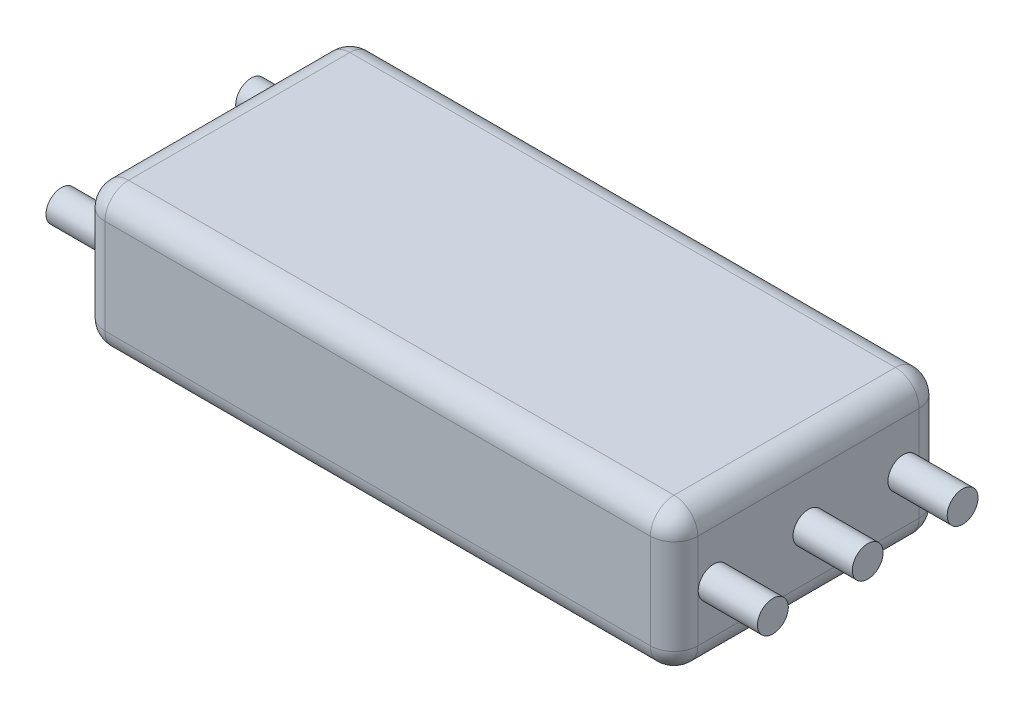
ISO-10303-21;
HEADER;
FILE_DESCRIPTION(('STEP AP214'),'2;1');
FILE_NAME('part.step','',(''),(''),'','','');
FILE_SCHEMA(('AUTOMOTIVE_DESIGN { 1 0 10303 214 1 1 1 1 }'));
ENDSEC;
DATA;
#1=APPLICATION_CONTEXT('core data for automotive mechanical design processes');
#2=APPLICATION_PROTOCOL_DEFINITION('international standard','automotive_design',2000,#1);
#3=PRODUCT_CONTEXT('',#1,'mechanical');
#4=PRODUCT('Part','Part','',(#3));
#5=PRODUCT_RELATED_PRODUCT_CATEGORY('part','',(#4));
#6=PRODUCT_DEFINITION_FORMATION('','',#4);
#7=PRODUCT_DEFINITION_CONTEXT('part definition',#1,'design');
#8=PRODUCT_DEFINITION('design','',#6,#7);
#9=PRODUCT_DEFINITION_SHAPE('','',#8);
#10=(LENGTH_UNIT() NAMED_UNIT(*) SI_UNIT(.MILLI.,.METRE.));
#11=(NAMED_UNIT(*) PLANE_ANGLE_UNIT() SI_UNIT($,.RADIAN.));
#12=(NAMED_UNIT(*) SI_UNIT($,.STERADIAN.) SOLID_ANGLE_UNIT());
#13=UNCERTAINTY_MEASURE_WITH_UNIT(LENGTH_MEASURE(1.E-05),#10,'distance_accuracy_value','');
#14=(GEOMETRIC_REPRESENTATION_CONTEXT(3) GLOBAL_UNCERTAINTY_ASSIGNED_CONTEXT((#13)) GLOBAL_UNIT_ASSIGNED_CONTEXT((#10,
#11,#12)) REPRESENTATION_CONTEXT('',''));
#15=CARTESIAN_POINT('',(0.,0.,0.));
#16=DIRECTION('',(0.,0.,1.));
#17=DIRECTION('',(1.,0.,0.));
#18=AXIS2_PLACEMENT_3D('',#15,#16,#17);
#19=CARTESIAN_POINT('',(31.75,7.62,14.3891));
#20=DIRECTION('',(-1.,0.,0.));
#21=DIRECTION('',(0.,0.,1.));
#22=AXIS2_PLACEMENT_3D('',#19,#20,#21);
#23=PLANE('',#22);
#24=CARTESIAN_POINT('',(31.75,0.,10.16));
#25=DIRECTION('',(-1.,0.,0.));
#26=DIRECTION('',(0.,0.,1.));
#27=AXIS2_PLACEMENT_3D('',#24,#25,#26);
#28=CIRCLE('',#27,1.651);
#29=CARTESIAN_POINT('',(31.75,0.,11.811));
#30=VERTEX_POINT('',#29);
#31=EDGE_CURVE('E541',#30,#30,#28,.T.);
#32=ORIENTED_EDGE('',*,*,#31,.T.);
#33=EDGE_LOOP('',(#32));
#34=FACE_BOUND('',#33,.T.);
#35=CARTESIAN_POINT('',(31.75,0.,-10.16));
#36=DIRECTION('',(-1.,0.,0.));
#37=DIRECTION('',(0.,0.,1.));
#38=AXIS2_PLACEMENT_3D('',#35,#36,#37);
#39=CIRCLE('',#38,1.651);
#40=CARTESIAN_POINT('',(31.75,0.,-8.509));
#41=VERTEX_POINT('',#40);
#42=EDGE_CURVE('E546',#41,#41,#39,.T.);
#43=ORIENTED_EDGE('',*,*,#42,.T.);
#44=EDGE_LOOP('',(#43));
#45=FACE_BOUND('',#44,.T.);
#46=CARTESIAN_POINT('',(31.75,0.,0.));
#47=DIRECTION('',(-1.,0.,0.));
#48=DIRECTION('',(0.,0.,1.));
#49=AXIS2_PLACEMENT_3D('',#46,#47,#48);
#50=CIRCLE('',#49,1.651);
#51=CARTESIAN_POINT('',(31.75,0.,1.651));
#52=VERTEX_POINT('',#51);
#53=EDGE_CURVE('E549',#52,#52,#50,.T.);
#54=ORIENTED_EDGE('',*,*,#53,.T.);
#55=EDGE_LOOP('',(#54));
#56=FACE_BOUND('',#55,.T.);
#57=DIRECTION('',(0.,-1.,0.));
#58=VECTOR('',#57,1.);
#59=CARTESIAN_POINT('',(31.75,7.62,-11.8491));
#60=LINE('',#59,#58);
#61=CARTESIAN_POINT('',(31.75,-5.08,-11.8491));
#62=VERTEX_POINT('',#61);
#63=CARTESIAN_POINT('',(31.75,5.08,-11.8491));
#64=VERTEX_POINT('',#63);
#65=EDGE_CURVE('E141',#62,#64,#60,.F.);
#66=ORIENTED_EDGE('',*,*,#65,.T.);
#67=DIRECTION('',(0.,0.,-1.));
#68=VECTOR('',#67,1.);
#69=CARTESIAN_POINT('',(31.75,5.08,14.3891));
#70=LINE('',#69,#68);
#71=CARTESIAN_POINT('',(31.75,5.08,11.8491));
#72=VERTEX_POINT('',#71);
#73=EDGE_CURVE('E179',#64,#72,#70,.F.);
#74=ORIENTED_EDGE('',*,*,#73,.T.);
#75=DIRECTION('',(0.,-1.,0.));
#76=VECTOR('',#75,1.);
#77=CARTESIAN_POINT('',(31.75,7.62,11.8491));
#78=LINE('',#77,#76);
#79=CARTESIAN_POINT('',(31.75,-5.08,11.8491));
#80=VERTEX_POINT('',#79);
#81=EDGE_CURVE('E176',#72,#80,#78,.T.);
#82=ORIENTED_EDGE('',*,*,#81,.T.);
#83=DIRECTION('',(0.,0.,-1.));
#84=VECTOR('',#83,1.);
#85=CARTESIAN_POINT('',(31.75,-5.08,-14.3891));
#86=LINE('',#85,#84);
#87=EDGE_CURVE('E171',#80,#62,#86,.T.);
#88=ORIENTED_EDGE('',*,*,#87,.T.);
#89=EDGE_LOOP('',(#66,#74,#82,#88));
#90=FACE_BOUND('',#89,.T.);
#91=ADVANCED_FACE('F45',(#34,#45,#56,#90),#23,.F.);
#92=CARTESIAN_POINT('',(-31.75,7.62,-14.3891));
#93=DIRECTION('',(0.,0.,1.));
#94=DIRECTION('',(1.,0.,0.));
#95=AXIS2_PLACEMENT_3D('',#92,#93,#94);
#96=PLANE('',#95);
#97=DIRECTION('',(0.,-1.,0.));
#98=VECTOR('',#97,1.);
#99=CARTESIAN_POINT('',(-29.21,7.62,-14.3891));
#100=LINE('',#99,#98);
#101=CARTESIAN_POINT('',(-29.21,-5.08,-14.3891));
#102=VERTEX_POINT('',#101);
#103=CARTESIAN_POINT('',(-29.21,5.08,-14.3891));
#104=VERTEX_POINT('',#103);
#105=EDGE_CURVE('E164',#102,#104,#100,.F.);
#106=ORIENTED_EDGE('',*,*,#105,.T.);
#107=DIRECTION('',(-1.,0.,0.));
#108=VECTOR('',#107,1.);
#109=CARTESIAN_POINT('',(-31.75,5.08,-14.3891));
#110=LINE('',#109,#108);
#111=CARTESIAN_POINT('',(29.21,5.08,-14.3891));
#112=VERTEX_POINT('',#111);
#113=EDGE_CURVE('E168',#104,#112,#110,.F.);
#114=ORIENTED_EDGE('',*,*,#113,.T.);
#115=DIRECTION('',(0.,-1.,0.));
#116=VECTOR('',#115,1.);
#117=CARTESIAN_POINT('',(29.21,7.62,-14.3891));
#118=LINE('',#117,#116);
#119=CARTESIAN_POINT('',(29.21,-5.08,-14.3891));
#120=VERTEX_POINT('',#119);
#121=EDGE_CURVE('E139',#112,#120,#118,.T.);
#122=ORIENTED_EDGE('',*,*,#121,.T.);
#123=DIRECTION('',(-1.,0.,0.));
#124=VECTOR('',#123,1.);
#125=CARTESIAN_POINT('',(-31.75,-5.08,-14.3891));
#126=LINE('',#125,#124);
#127=EDGE_CURVE('E158',#120,#102,#126,.T.);
#128=ORIENTED_EDGE('',*,*,#127,.T.);
#129=EDGE_LOOP('',(#106,#114,#122,#128));
#130=FACE_BOUND('',#129,.T.);
#131=ADVANCED_FACE('F166',(#130),#96,.F.);
#132=CARTESIAN_POINT('',(-31.75,7.62,14.3891));
#133=DIRECTION('',(1.,0.,0.));
#134=DIRECTION('',(0.,0.,-1.));
#135=AXIS2_PLACEMENT_3D('',#132,#133,#134);
#136=PLANE('',#135);
#137=CARTESIAN_POINT('',(-31.75,0.,10.16));
#138=DIRECTION('',(1.,0.,0.));
#139=DIRECTION('',(0.,0.,-1.));
#140=AXIS2_PLACEMENT_3D('',#137,#138,#139);
#141=CIRCLE('',#140,1.651);
#142=CARTESIAN_POINT('',(-31.75,0.,8.509));
#143=VERTEX_POINT('',#142);
#144=EDGE_CURVE('E527',#143,#143,#141,.T.);
#145=ORIENTED_EDGE('',*,*,#144,.T.);
#146=EDGE_LOOP('',(#145));
#147=FACE_BOUND('',#146,.T.);
#148=CARTESIAN_POINT('',(-31.75,0.,-10.16));
#149=DIRECTION('',(1.,0.,0.));
#150=DIRECTION('',(0.,0.,-1.));
#151=AXIS2_PLACEMENT_3D('',#148,#149,#150);
#152=CIRCLE('',#151,1.651);
#153=CARTESIAN_POINT('',(-31.75,0.,-11.811));
#154=VERTEX_POINT('',#153);
#155=EDGE_CURVE('E530',#154,#154,#152,.T.);
#156=ORIENTED_EDGE('',*,*,#155,.T.);
#157=EDGE_LOOP('',(#156));
#158=FACE_BOUND('',#157,.T.);
#159=DIRECTION('',(0.,-1.,0.));
#160=VECTOR('',#159,1.);
#161=CARTESIAN_POINT('',(-31.75,7.62,11.8491));
#162=LINE('',#161,#160);
#163=CARTESIAN_POINT('',(-31.75,-5.08,11.8491));
#164=VERTEX_POINT('',#163);
#165=CARTESIAN_POINT('',(-31.75,5.08,11.8491));
#166=VERTEX_POINT('',#165);
#167=EDGE_CURVE('E183',#164,#166,#162,.F.);
#168=ORIENTED_EDGE('',*,*,#167,.T.);
#169=DIRECTION('',(0.,0.,1.));
#170=VECTOR('',#169,1.);
#171=CARTESIAN_POINT('',(-31.75,5.08,14.3891));
#172=LINE('',#171,#170);
#173=CARTESIAN_POINT('',(-31.75,5.08,-11.8491));
#174=VERTEX_POINT('',#173);
#175=EDGE_CURVE('E188',#166,#174,#172,.F.);
#176=ORIENTED_EDGE('',*,*,#175,.T.);
#177=DIRECTION('',(0.,-1.,0.));
#178=VECTOR('',#177,1.);
#179=CARTESIAN_POINT('',(-31.75,7.62,-11.8491));
#180=LINE('',#179,#178);
#181=CARTESIAN_POINT('',(-31.75,-5.08,-11.8491));
#182=VERTEX_POINT('',#181);
#183=EDGE_CURVE('E185',#174,#182,#180,.T.);
#184=ORIENTED_EDGE('',*,*,#183,.T.);
#185=DIRECTION('',(0.,0.,1.));
#186=VECTOR('',#185,1.);
#187=CARTESIAN_POINT('',(-31.75,-5.08,14.3891));
#188=LINE('',#187,#186);
#189=EDGE_CURVE('E181',#182,#164,#188,.T.);
#190=ORIENTED_EDGE('',*,*,#189,.T.);
#191=EDGE_LOOP('',(#168,#176,#184,#190));
#192=FACE_BOUND('',#191,.T.);
#193=ADVANCED_FACE('F293',(#147,#158,#192),#136,.F.);
#194=CARTESIAN_POINT('',(-31.75,7.62,14.3891));
#195=DIRECTION('',(0.,0.,-1.));
#196=DIRECTION('',(-1.,0.,0.));
#197=AXIS2_PLACEMENT_3D('',#194,#195,#196);
#198=PLANE('',#197);
#199=DIRECTION('',(0.,-1.,0.));
#200=VECTOR('',#199,1.);
#201=CARTESIAN_POINT('',(29.21,7.62,14.3891));
#202=LINE('',#201,#200);
#203=CARTESIAN_POINT('',(29.21,-5.08,14.3891));
#204=VERTEX_POINT('',#203);
#205=CARTESIAN_POINT('',(29.21,5.08,14.3891));
#206=VERTEX_POINT('',#205);
#207=EDGE_CURVE('E192',#204,#206,#202,.F.);
#208=ORIENTED_EDGE('',*,*,#207,.T.);
#209=DIRECTION('',(1.,0.,0.));
#210=VECTOR('',#209,1.);
#211=CARTESIAN_POINT('',(-31.75,5.08,14.3891));
#212=LINE('',#211,#210);
#213=CARTESIAN_POINT('',(-29.21,5.08,14.3891));
#214=VERTEX_POINT('',#213);
#215=EDGE_CURVE('E197',#206,#214,#212,.F.);
#216=ORIENTED_EDGE('',*,*,#215,.T.);
#217=DIRECTION('',(0.,-1.,0.));
#218=VECTOR('',#217,1.);
#219=CARTESIAN_POINT('',(-29.21,7.62,14.3891));
#220=LINE('',#219,#218);
#221=CARTESIAN_POINT('',(-29.21,-5.08,14.3891));
#222=VERTEX_POINT('',#221);
#223=EDGE_CURVE('E194',#214,#222,#220,.T.);
#224=ORIENTED_EDGE('',*,*,#223,.T.);
#225=DIRECTION('',(1.,0.,0.));
#226=VECTOR('',#225,1.);
#227=CARTESIAN_POINT('',(31.75,-5.08,14.3891));
#228=LINE('',#227,#226);
#229=EDGE_CURVE('E190',#222,#204,#228,.T.);
#230=ORIENTED_EDGE('',*,*,#229,.T.);
#231=EDGE_LOOP('',(#208,#216,#224,#230));
#232=FACE_BOUND('',#231,.T.);
#233=ADVANCED_FACE('F304',(#232),#198,.F.);
#234=CARTESIAN_POINT('',(0.,7.62,0.));
#235=DIRECTION('',(0.,-1.,0.));
#236=DIRECTION('',(0.,0.,-1.));
#237=AXIS2_PLACEMENT_3D('',#234,#235,#236);
#238=PLANE('',#237);
#239=DIRECTION('',(0.,0.,1.));
#240=VECTOR('',#239,1.);
#241=CARTESIAN_POINT('',(-29.21,7.62,0.));
#242=LINE('',#241,#240);
#243=CARTESIAN_POINT('',(-29.21,7.62,-11.8491));
#244=VERTEX_POINT('',#243);
#245=CARTESIAN_POINT('',(-29.21,7.62,11.8491));
#246=VERTEX_POINT('',#245);
#247=EDGE_CURVE('E203',#244,#246,#242,.T.);
#248=ORIENTED_EDGE('',*,*,#247,.T.);
#249=DIRECTION('',(1.,0.,0.));
#250=VECTOR('',#249,1.);
#251=CARTESIAN_POINT('',(0.,7.62,11.8491));
#252=LINE('',#251,#250);
#253=CARTESIAN_POINT('',(29.21,7.62,11.8491));
#254=VERTEX_POINT('',#253);
#255=EDGE_CURVE('E205',#246,#254,#252,.T.);
#256=ORIENTED_EDGE('',*,*,#255,.T.);
#257=DIRECTION('',(0.,0.,-1.));
#258=VECTOR('',#257,1.);
#259=CARTESIAN_POINT('',(29.21,7.62,0.));
#260=LINE('',#259,#258);
#261=CARTESIAN_POINT('',(29.21,7.62,-11.8491));
#262=VERTEX_POINT('',#261);
#263=EDGE_CURVE('E199',#254,#262,#260,.T.);
#264=ORIENTED_EDGE('',*,*,#263,.T.);
#265=DIRECTION('',(-1.,0.,0.));
#266=VECTOR('',#265,1.);
#267=CARTESIAN_POINT('',(0.,7.62,-11.8491));
#268=LINE('',#267,#266);
#269=EDGE_CURVE('E201',#262,#244,#268,.T.);
#270=ORIENTED_EDGE('',*,*,#269,.T.);
#271=EDGE_LOOP('',(#248,#256,#264,#270));
#272=FACE_BOUND('',#271,.T.);
#273=ADVANCED_FACE('F285',(#272),#238,.F.);
#274=CARTESIAN_POINT('',(0.,-7.62,0.));
#275=DIRECTION('',(0.,-1.,0.));
#276=DIRECTION('',(0.,0.,-1.));
#277=AXIS2_PLACEMENT_3D('',#274,#275,#276);
#278=PLANE('',#277);
#279=DIRECTION('',(0.,0.,1.));
#280=VECTOR('',#279,1.);
#281=CARTESIAN_POINT('',(-29.21,-7.62,-14.3891));
#282=LINE('',#281,#280);
#283=CARTESIAN_POINT('',(-29.21,-7.62,11.8491));
#284=VERTEX_POINT('',#283);
#285=CARTESIAN_POINT('',(-29.21,-7.62,-11.8491));
#286=VERTEX_POINT('',#285);
#287=EDGE_CURVE('E54',#284,#286,#282,.F.);
#288=ORIENTED_EDGE('',*,*,#287,.T.);
#289=DIRECTION('',(-1.,0.,0.));
#290=VECTOR('',#289,1.);
#291=CARTESIAN_POINT('',(31.75,-7.62,-11.8491));
#292=LINE('',#291,#290);
#293=CARTESIAN_POINT('',(29.21,-7.62,-11.8491));
#294=VERTEX_POINT('',#293);
#295=EDGE_CURVE('E11',#286,#294,#292,.F.);
#296=ORIENTED_EDGE('',*,*,#295,.T.);
#297=DIRECTION('',(0.,0.,-1.));
#298=VECTOR('',#297,1.);
#299=CARTESIAN_POINT('',(29.21,-7.62,14.3891));
#300=LINE('',#299,#298);
#301=CARTESIAN_POINT('',(29.21,-7.62,11.8491));
#302=VERTEX_POINT('',#301);
#303=EDGE_CURVE('E208',#294,#302,#300,.F.);
#304=ORIENTED_EDGE('',*,*,#303,.T.);
#305=DIRECTION('',(1.,0.,0.));
#306=VECTOR('',#305,1.);
#307=CARTESIAN_POINT('',(-31.75,-7.62,11.8491));
#308=LINE('',#307,#306);
#309=EDGE_CURVE('E65',#302,#284,#308,.F.);
#310=ORIENTED_EDGE('',*,*,#309,.T.);
#311=EDGE_LOOP('',(#288,#296,#304,#310));
#312=FACE_BOUND('',#311,.T.);
#313=ADVANCED_FACE('F517',(#312),#278,.T.);
#314=CARTESIAN_POINT('',(-29.21,7.62,11.8491));
#315=DIRECTION('',(0.,-1.,0.));
#316=DIRECTION('',(0.,0.,-1.));
#317=AXIS2_PLACEMENT_3D('',#314,#315,#316);
#318=CYLINDRICAL_SURFACE('',#317,2.54);
#319=CARTESIAN_POINT('',(-29.21,5.08,11.8491));
#320=DIRECTION('',(0.,1.,0.));
#321=DIRECTION('',(0.,0.,1.));
#322=AXIS2_PLACEMENT_3D('',#319,#320,#321);
#323=CIRCLE('',#322,2.54);
#324=EDGE_CURVE('E49',#166,#214,#323,.T.);
#325=ORIENTED_EDGE('',*,*,#324,.F.);
#326=ORIENTED_EDGE('',*,*,#167,.F.);
#327=CARTESIAN_POINT('',(-29.21,-5.08,11.8491));
#328=DIRECTION('',(0.,-1.,0.));
#329=DIRECTION('',(0.,0.,-1.));
#330=AXIS2_PLACEMENT_3D('',#327,#328,#329);
#331=CIRCLE('',#330,2.54);
#332=EDGE_CURVE('E262',#222,#164,#331,.T.);
#333=ORIENTED_EDGE('',*,*,#332,.F.);
#334=ORIENTED_EDGE('',*,*,#223,.F.);
#335=EDGE_LOOP('',(#325,#326,#333,#334));
#336=FACE_BOUND('',#335,.T.);
#337=ADVANCED_FACE('F47',(#336),#318,.T.);
#338=CARTESIAN_POINT('',(-29.21,5.08,11.8491));
#339=DIRECTION('',(0.,0.,1.));
#340=DIRECTION('',(1.,0.,0.));
#341=AXIS2_PLACEMENT_3D('',#338,#339,#340);
#342=SPHERICAL_SURFACE('',#341,2.54);
#343=CARTESIAN_POINT('',(-29.21,5.08,11.8491));
#344=DIRECTION('',(0.,0.,1.));
#345=DIRECTION('',(1.,0.,0.));
#346=AXIS2_PLACEMENT_3D('',#343,#344,#345);
#347=CIRCLE('',#346,2.54);
#348=EDGE_CURVE('E257',#166,#246,#347,.F.);
#349=ORIENTED_EDGE('',*,*,#348,.F.);
#350=ORIENTED_EDGE('',*,*,#324,.T.);
#351=CARTESIAN_POINT('',(-29.21,5.08,11.8491));
#352=DIRECTION('',(-1.,0.,0.));
#353=DIRECTION('',(0.,0.,1.));
#354=AXIS2_PLACEMENT_3D('',#351,#352,#353);
#355=CIRCLE('',#354,2.54);
#356=EDGE_CURVE('E260',#246,#214,#355,.F.);
#357=ORIENTED_EDGE('',*,*,#356,.F.);
#358=EDGE_LOOP('',(#349,#350,#357));
#359=FACE_BOUND('',#358,.T.);
#360=ADVANCED_FACE('F273',(#359),#342,.T.);
#361=CARTESIAN_POINT('',(-29.21,-5.08,11.8491));
#362=DIRECTION('',(-1.,0.,0.));
#363=DIRECTION('',(0.,-1.,0.));
#364=AXIS2_PLACEMENT_3D('',#361,#362,#363);
#365=SPHERICAL_SURFACE('',#364,2.54);
#366=CARTESIAN_POINT('',(-29.21,-5.08,11.8491));
#367=DIRECTION('',(-1.,0.,0.));
#368=DIRECTION('',(0.,0.,1.));
#369=AXIS2_PLACEMENT_3D('',#366,#367,#368);
#370=CIRCLE('',#369,2.54);
#371=EDGE_CURVE('E252',#222,#284,#370,.F.);
#372=ORIENTED_EDGE('',*,*,#371,.F.);
#373=ORIENTED_EDGE('',*,*,#332,.T.);
#374=CARTESIAN_POINT('',(-29.21,-5.08,11.8491));
#375=DIRECTION('',(0.,0.,1.));
#376=DIRECTION('',(1.,0.,0.));
#377=AXIS2_PLACEMENT_3D('',#374,#375,#376);
#378=CIRCLE('',#377,2.54);
#379=EDGE_CURVE('E254',#284,#164,#378,.F.);
#380=ORIENTED_EDGE('',*,*,#379,.F.);
#381=EDGE_LOOP('',(#372,#373,#380));
#382=FACE_BOUND('',#381,.T.);
#383=ADVANCED_FACE('F607',(#382),#365,.T.);
#384=CARTESIAN_POINT('',(0.,5.08,11.8491));
#385=DIRECTION('',(1.,0.,0.));
#386=DIRECTION('',(0.,0.,-1.));
#387=AXIS2_PLACEMENT_3D('',#384,#385,#386);
#388=CYLINDRICAL_SURFACE('',#387,2.54);
#389=ORIENTED_EDGE('',*,*,#356,.T.);
#390=ORIENTED_EDGE('',*,*,#215,.F.);
#391=CARTESIAN_POINT('',(29.21,5.08,11.8491));
#392=DIRECTION('',(1.,0.,0.));
#393=DIRECTION('',(0.,0.,-1.));
#394=AXIS2_PLACEMENT_3D('',#391,#392,#393);
#395=CIRCLE('',#394,2.54);
#396=EDGE_CURVE('E246',#254,#206,#395,.T.);
#397=ORIENTED_EDGE('',*,*,#396,.F.);
#398=ORIENTED_EDGE('',*,*,#255,.F.);
#399=EDGE_LOOP('',(#389,#390,#397,#398));
#400=FACE_BOUND('',#399,.T.);
#401=ADVANCED_FACE('F281',(#400),#388,.T.);
#402=CARTESIAN_POINT('',(-29.21,5.08,0.));
#403=DIRECTION('',(0.,0.,1.));
#404=DIRECTION('',(1.,0.,0.));
#405=AXIS2_PLACEMENT_3D('',#402,#403,#404);
#406=CYLINDRICAL_SURFACE('',#405,2.54);
#407=ORIENTED_EDGE('',*,*,#348,.T.);
#408=ORIENTED_EDGE('',*,*,#247,.F.);
#409=CARTESIAN_POINT('',(-29.21,5.08,-11.8491));
#410=DIRECTION('',(0.,0.,-1.));
#411=DIRECTION('',(-1.,0.,0.));
#412=AXIS2_PLACEMENT_3D('',#409,#410,#411);
#413=CIRCLE('',#412,2.54);
#414=EDGE_CURVE('E243',#174,#244,#413,.T.);
#415=ORIENTED_EDGE('',*,*,#414,.F.);
#416=ORIENTED_EDGE('',*,*,#175,.F.);
#417=EDGE_LOOP('',(#407,#408,#415,#416));
#418=FACE_BOUND('',#417,.T.);
#419=ADVANCED_FACE('F290',(#418),#406,.T.);
#420=CARTESIAN_POINT('',(-29.21,7.62,-11.8491));
#421=DIRECTION('',(0.,-1.,0.));
#422=DIRECTION('',(0.,0.,-1.));
#423=AXIS2_PLACEMENT_3D('',#420,#421,#422);
#424=CYLINDRICAL_SURFACE('',#423,2.54);
#425=CARTESIAN_POINT('',(-29.21,-5.08,-11.8491));
#426=DIRECTION('',(0.,-1.,0.));
#427=DIRECTION('',(0.,0.,-1.));
#428=AXIS2_PLACEMENT_3D('',#425,#426,#427);
#429=CIRCLE('',#428,2.54);
#430=EDGE_CURVE('E237',#182,#102,#429,.T.);
#431=ORIENTED_EDGE('',*,*,#430,.F.);
#432=ORIENTED_EDGE('',*,*,#183,.F.);
#433=CARTESIAN_POINT('',(-29.21,5.08,-11.8491));
#434=DIRECTION('',(0.,1.,0.));
#435=DIRECTION('',(0.,0.,1.));
#436=AXIS2_PLACEMENT_3D('',#433,#434,#435);
#437=CIRCLE('',#436,2.54);
#438=EDGE_CURVE('E240',#104,#174,#437,.T.);
#439=ORIENTED_EDGE('',*,*,#438,.F.);
#440=ORIENTED_EDGE('',*,*,#105,.F.);
#441=EDGE_LOOP('',(#431,#432,#439,#440));
#442=FACE_BOUND('',#441,.T.);
#443=ADVANCED_FACE('F297',(#442),#424,.T.);
#444=CARTESIAN_POINT('',(-29.21,-5.08,14.3891));
#445=DIRECTION('',(0.,0.,-1.));
#446=DIRECTION('',(-1.,0.,0.));
#447=AXIS2_PLACEMENT_3D('',#444,#445,#446);
#448=CYLINDRICAL_SURFACE('',#447,2.54);
#449=ORIENTED_EDGE('',*,*,#379,.T.);
#450=ORIENTED_EDGE('',*,*,#189,.F.);
#451=CARTESIAN_POINT('',(-29.21,-5.08,-11.8491));
#452=DIRECTION('',(0.,0.,-1.));
#453=DIRECTION('',(-1.,0.,0.));
#454=AXIS2_PLACEMENT_3D('',#451,#452,#453);
#455=CIRCLE('',#454,2.54);
#456=EDGE_CURVE('E235',#286,#182,#455,.T.);
#457=ORIENTED_EDGE('',*,*,#456,.F.);
#458=ORIENTED_EDGE('',*,*,#287,.F.);
#459=EDGE_LOOP('',(#449,#450,#457,#458));
#460=FACE_BOUND('',#459,.T.);
#461=ADVANCED_FACE('F302',(#460),#448,.T.);
#462=CARTESIAN_POINT('',(-31.75,-5.08,11.8491));
#463=DIRECTION('',(-1.,0.,0.));
#464=DIRECTION('',(0.,0.,1.));
#465=AXIS2_PLACEMENT_3D('',#462,#463,#464);
#466=CYLINDRICAL_SURFACE('',#465,2.54);
#467=ORIENTED_EDGE('',*,*,#371,.T.);
#468=ORIENTED_EDGE('',*,*,#309,.F.);
#469=CARTESIAN_POINT('',(29.21,-5.08,11.8491));
#470=DIRECTION('',(1.,0.,0.));
#471=DIRECTION('',(0.,0.,-1.));
#472=AXIS2_PLACEMENT_3D('',#469,#470,#471);
#473=CIRCLE('',#472,2.54);
#474=EDGE_CURVE('E232',#204,#302,#473,.T.);
#475=ORIENTED_EDGE('',*,*,#474,.F.);
#476=ORIENTED_EDGE('',*,*,#229,.F.);
#477=EDGE_LOOP('',(#467,#468,#475,#476));
#478=FACE_BOUND('',#477,.T.);
#479=ADVANCED_FACE('F313',(#478),#466,.T.);
#480=CARTESIAN_POINT('',(29.21,7.62,11.8491));
#481=DIRECTION('',(0.,-1.,0.));
#482=DIRECTION('',(0.,0.,-1.));
#483=AXIS2_PLACEMENT_3D('',#480,#481,#482);
#484=CYLINDRICAL_SURFACE('',#483,2.54);
#485=CARTESIAN_POINT('',(29.21,5.08,11.8491));
#486=DIRECTION('',(0.,1.,0.));
#487=DIRECTION('',(0.,0.,1.));
#488=AXIS2_PLACEMENT_3D('',#485,#486,#487);
#489=CIRCLE('',#488,2.54);
#490=EDGE_CURVE('E249',#206,#72,#489,.T.);
#491=ORIENTED_EDGE('',*,*,#490,.F.);
#492=ORIENTED_EDGE('',*,*,#207,.F.);
#493=CARTESIAN_POINT('',(29.21,-5.08,11.8491));
#494=DIRECTION('',(0.,-1.,0.));
#495=DIRECTION('',(0.,0.,-1.));
#496=AXIS2_PLACEMENT_3D('',#493,#494,#495);
#497=CIRCLE('',#496,2.54);
#498=EDGE_CURVE('E229',#80,#204,#497,.T.);
#499=ORIENTED_EDGE('',*,*,#498,.F.);
#500=ORIENTED_EDGE('',*,*,#81,.F.);
#501=EDGE_LOOP('',(#491,#492,#499,#500));
#502=FACE_BOUND('',#501,.T.);
#503=ADVANCED_FACE('F309',(#502),#484,.T.);
#504=CARTESIAN_POINT('',(29.21,5.08,11.8491));
#505=DIRECTION('',(0.,0.,1.));
#506=DIRECTION('',(1.,0.,0.));
#507=AXIS2_PLACEMENT_3D('',#504,#505,#506);
#508=SPHERICAL_SURFACE('',#507,2.54);
#509=ORIENTED_EDGE('',*,*,#396,.T.);
#510=ORIENTED_EDGE('',*,*,#490,.T.);
#511=CARTESIAN_POINT('',(29.21,5.08,11.8491));
#512=DIRECTION('',(0.,0.,1.));
#513=DIRECTION('',(1.,0.,0.));
#514=AXIS2_PLACEMENT_3D('',#511,#512,#513);
#515=CIRCLE('',#514,2.54);
#516=EDGE_CURVE('E226',#254,#72,#515,.F.);
#517=ORIENTED_EDGE('',*,*,#516,.F.);
#518=EDGE_LOOP('',(#509,#510,#517));
#519=FACE_BOUND('',#518,.T.);
#520=ADVANCED_FACE('F323',(#519),#508,.T.);
#521=CARTESIAN_POINT('',(-29.21,5.08,-11.8491));
#522=DIRECTION('',(-1.,0.,0.));
#523=DIRECTION('',(0.,0.,1.));
#524=AXIS2_PLACEMENT_3D('',#521,#522,#523);
#525=SPHERICAL_SURFACE('',#524,2.54);
#526=ORIENTED_EDGE('',*,*,#438,.T.);
#527=ORIENTED_EDGE('',*,*,#414,.T.);
#528=CARTESIAN_POINT('',(-29.21,5.08,-11.8491));
#529=DIRECTION('',(-1.,0.,0.));
#530=DIRECTION('',(0.,0.,1.));
#531=AXIS2_PLACEMENT_3D('',#528,#529,#530);
#532=CIRCLE('',#531,2.54);
#533=EDGE_CURVE('E223',#104,#244,#532,.F.);
#534=ORIENTED_EDGE('',*,*,#533,.F.);
#535=EDGE_LOOP('',(#526,#527,#534));
#536=FACE_BOUND('',#535,.T.);
#537=ADVANCED_FACE('F333',(#536),#525,.T.);
#538=CARTESIAN_POINT('',(-29.21,-5.08,-11.8491));
#539=DIRECTION('',(-1.,0.,0.));
#540=DIRECTION('',(0.,-1.,0.));
#541=AXIS2_PLACEMENT_3D('',#538,#539,#540);
#542=SPHERICAL_SURFACE('',#541,2.54);
#543=ORIENTED_EDGE('',*,*,#456,.T.);
#544=ORIENTED_EDGE('',*,*,#430,.T.);
#545=CARTESIAN_POINT('',(-29.21,-5.08,-11.8491));
#546=DIRECTION('',(-1.,0.,0.));
#547=DIRECTION('',(0.,0.,1.));
#548=AXIS2_PLACEMENT_3D('',#545,#546,#547);
#549=CIRCLE('',#548,2.54);
#550=EDGE_CURVE('E161',#286,#102,#549,.F.);
#551=ORIENTED_EDGE('',*,*,#550,.F.);
#552=EDGE_LOOP('',(#543,#544,#551));
#553=FACE_BOUND('',#552,.T.);
#554=ADVANCED_FACE('F335',(#553),#542,.T.);
#555=CARTESIAN_POINT('',(29.21,-5.08,11.8491));
#556=DIRECTION('',(0.,0.,1.));
#557=DIRECTION('',(0.,-1.,0.));
#558=AXIS2_PLACEMENT_3D('',#555,#556,#557);
#559=SPHERICAL_SURFACE('',#558,2.54);
#560=ORIENTED_EDGE('',*,*,#498,.T.);
#561=ORIENTED_EDGE('',*,*,#474,.T.);
#562=CARTESIAN_POINT('',(29.21,-5.08,11.8491));
#563=DIRECTION('',(0.,0.,1.));
#564=DIRECTION('',(1.,0.,0.));
#565=AXIS2_PLACEMENT_3D('',#562,#563,#564);
#566=CIRCLE('',#565,2.54);
#567=EDGE_CURVE('E219',#80,#302,#566,.F.);
#568=ORIENTED_EDGE('',*,*,#567,.F.);
#569=EDGE_LOOP('',(#560,#561,#568));
#570=FACE_BOUND('',#569,.T.);
#571=ADVANCED_FACE('F315',(#570),#559,.T.);
#572=CARTESIAN_POINT('',(29.21,5.08,0.));
#573=DIRECTION('',(0.,0.,-1.));
#574=DIRECTION('',(-1.,0.,0.));
#575=AXIS2_PLACEMENT_3D('',#572,#573,#574);
#576=CYLINDRICAL_SURFACE('',#575,2.54);
#577=ORIENTED_EDGE('',*,*,#516,.T.);
#578=ORIENTED_EDGE('',*,*,#73,.F.);
#579=CARTESIAN_POINT('',(29.21,5.08,-11.8491));
#580=DIRECTION('',(0.,0.,-1.));
#581=DIRECTION('',(-1.,0.,0.));
#582=AXIS2_PLACEMENT_3D('',#579,#580,#581);
#583=CIRCLE('',#582,2.54);
#584=EDGE_CURVE('E216',#262,#64,#583,.T.);
#585=ORIENTED_EDGE('',*,*,#584,.F.);
#586=ORIENTED_EDGE('',*,*,#263,.F.);
#587=EDGE_LOOP('',(#577,#578,#585,#586));
#588=FACE_BOUND('',#587,.T.);
#589=ADVANCED_FACE('F325',(#588),#576,.T.);
#590=CARTESIAN_POINT('',(0.,5.08,-11.8491));
#591=DIRECTION('',(-1.,0.,0.));
#592=DIRECTION('',(0.,0.,1.));
#593=AXIS2_PLACEMENT_3D('',#590,#591,#592);
#594=CYLINDRICAL_SURFACE('',#593,2.54);
#595=ORIENTED_EDGE('',*,*,#533,.T.);
#596=ORIENTED_EDGE('',*,*,#269,.F.);
#597=CARTESIAN_POINT('',(29.21,5.08,-11.8491));
#598=DIRECTION('',(1.,0.,0.));
#599=DIRECTION('',(0.,0.,-1.));
#600=AXIS2_PLACEMENT_3D('',#597,#598,#599);
#601=CIRCLE('',#600,2.54);
#602=EDGE_CURVE('E155',#112,#262,#601,.T.);
#603=ORIENTED_EDGE('',*,*,#602,.F.);
#604=ORIENTED_EDGE('',*,*,#113,.F.);
#605=EDGE_LOOP('',(#595,#596,#603,#604));
#606=FACE_BOUND('',#605,.T.);
#607=ADVANCED_FACE('F331',(#606),#594,.T.);
#608=CARTESIAN_POINT('',(-31.75,-5.08,-11.8491));
#609=DIRECTION('',(1.,0.,0.));
#610=DIRECTION('',(0.,0.,-1.));
#611=AXIS2_PLACEMENT_3D('',#608,#609,#610);
#612=CYLINDRICAL_SURFACE('',#611,2.54);
#613=ORIENTED_EDGE('',*,*,#550,.T.);
#614=ORIENTED_EDGE('',*,*,#127,.F.);
#615=CARTESIAN_POINT('',(29.21,-5.08,-11.8491));
#616=DIRECTION('',(1.,0.,0.));
#617=DIRECTION('',(0.,0.,-1.));
#618=AXIS2_PLACEMENT_3D('',#615,#616,#617);
#619=CIRCLE('',#618,2.54);
#620=EDGE_CURVE('E147',#294,#120,#619,.T.);
#621=ORIENTED_EDGE('',*,*,#620,.F.);
#622=ORIENTED_EDGE('',*,*,#295,.F.);
#623=EDGE_LOOP('',(#613,#614,#621,#622));
#624=FACE_BOUND('',#623,.T.);
#625=ADVANCED_FACE('F159',(#624),#612,.T.);
#626=CARTESIAN_POINT('',(29.21,-5.08,14.3891));
#627=DIRECTION('',(0.,0.,1.));
#628=DIRECTION('',(1.,0.,0.));
#629=AXIS2_PLACEMENT_3D('',#626,#627,#628);
#630=CYLINDRICAL_SURFACE('',#629,2.54);
#631=ORIENTED_EDGE('',*,*,#567,.T.);
#632=ORIENTED_EDGE('',*,*,#303,.F.);
#633=CARTESIAN_POINT('',(29.21,-5.08,-11.8491));
#634=DIRECTION('',(0.,0.,-1.));
#635=DIRECTION('',(-1.,0.,0.));
#636=AXIS2_PLACEMENT_3D('',#633,#634,#635);
#637=CIRCLE('',#636,2.54);
#638=EDGE_CURVE('E151',#62,#294,#637,.T.);
#639=ORIENTED_EDGE('',*,*,#638,.F.);
#640=ORIENTED_EDGE('',*,*,#87,.F.);
#641=EDGE_LOOP('',(#631,#632,#639,#640));
#642=FACE_BOUND('',#641,.T.);
#643=ADVANCED_FACE('F318',(#642),#630,.T.);
#644=CARTESIAN_POINT('',(29.21,5.08,-11.8491));
#645=DIRECTION('',(0.,1.,0.));
#646=DIRECTION('',(0.,0.,1.));
#647=AXIS2_PLACEMENT_3D('',#644,#645,#646);
#648=SPHERICAL_SURFACE('',#647,2.54);
#649=ORIENTED_EDGE('',*,*,#602,.T.);
#650=ORIENTED_EDGE('',*,*,#584,.T.);
#651=CARTESIAN_POINT('',(29.21,5.08,-11.8491));
#652=DIRECTION('',(0.,1.,0.));
#653=DIRECTION('',(0.,0.,1.));
#654=AXIS2_PLACEMENT_3D('',#651,#652,#653);
#655=CIRCLE('',#654,2.54);
#656=EDGE_CURVE('E143',#112,#64,#655,.F.);
#657=ORIENTED_EDGE('',*,*,#656,.F.);
#658=EDGE_LOOP('',(#649,#650,#657));
#659=FACE_BOUND('',#658,.T.);
#660=ADVANCED_FACE('F329',(#659),#648,.T.);
#661=CARTESIAN_POINT('',(29.21,-5.08,-11.8491));
#662=DIRECTION('',(0.,-1.,0.));
#663=DIRECTION('',(0.,0.,-1.));
#664=AXIS2_PLACEMENT_3D('',#661,#662,#663);
#665=SPHERICAL_SURFACE('',#664,2.54);
#666=ORIENTED_EDGE('',*,*,#638,.T.);
#667=ORIENTED_EDGE('',*,*,#620,.T.);
#668=CARTESIAN_POINT('',(29.21,-5.08,-11.8491));
#669=DIRECTION('',(0.,-1.,0.));
#670=DIRECTION('',(0.,0.,-1.));
#671=AXIS2_PLACEMENT_3D('',#668,#669,#670);
#672=CIRCLE('',#671,2.54);
#673=EDGE_CURVE('E135',#62,#120,#672,.F.);
#674=ORIENTED_EDGE('',*,*,#673,.F.);
#675=EDGE_LOOP('',(#666,#667,#674));
#676=FACE_BOUND('',#675,.T.);
#677=ADVANCED_FACE('F149',(#676),#665,.T.);
#678=CARTESIAN_POINT('',(29.21,7.62,-11.8491));
#679=DIRECTION('',(0.,-1.,0.));
#680=DIRECTION('',(0.,0.,-1.));
#681=AXIS2_PLACEMENT_3D('',#678,#679,#680);
#682=CYLINDRICAL_SURFACE('',#681,2.54);
#683=ORIENTED_EDGE('',*,*,#656,.T.);
#684=ORIENTED_EDGE('',*,*,#65,.F.);
#685=ORIENTED_EDGE('',*,*,#673,.T.);
#686=ORIENTED_EDGE('',*,*,#121,.F.);
#687=EDGE_LOOP('',(#683,#684,#685,#686));
#688=FACE_BOUND('',#687,.T.);
#689=ADVANCED_FACE('F137',(#688),#682,.T.);
#690=CARTESIAN_POINT('',(38.1,0.,0.));
#691=DIRECTION('',(-1.,0.,0.));
#692=DIRECTION('',(0.,0.,1.));
#693=AXIS2_PLACEMENT_3D('',#690,#691,#692);
#694=CYLINDRICAL_SURFACE('',#693,1.651);
#695=CARTESIAN_POINT('',(38.1,0.,0.));
#696=DIRECTION('',(-1.,0.,0.));
#697=DIRECTION('',(0.,0.,1.));
#698=AXIS2_PLACEMENT_3D('',#695,#696,#697);
#699=CIRCLE('',#698,1.651);
#700=CARTESIAN_POINT('',(38.1,0.,1.651));
#701=VERTEX_POINT('',#700);
#702=EDGE_CURVE('E144',#701,#701,#699,.T.);
#703=ORIENTED_EDGE('',*,*,#702,.T.);
#704=EDGE_LOOP('',(#703));
#705=FACE_BOUND('',#704,.T.);
#706=ORIENTED_EDGE('',*,*,#53,.F.);
#707=EDGE_LOOP('',(#706));
#708=FACE_BOUND('',#707,.T.);
#709=ADVANCED_FACE('F357',(#705,#708),#694,.T.);
#710=CARTESIAN_POINT('',(38.1,0.,0.));
#711=DIRECTION('',(-1.,0.,0.));
#712=DIRECTION('',(0.,0.,1.));
#713=AXIS2_PLACEMENT_3D('',#710,#711,#712);
#714=PLANE('',#713);
#715=ORIENTED_EDGE('',*,*,#702,.F.);
#716=EDGE_LOOP('',(#715));
#717=FACE_BOUND('',#716,.T.);
#718=ADVANCED_FACE('F419',(#717),#714,.F.);
#719=CARTESIAN_POINT('',(38.1,0.,-10.16));
#720=DIRECTION('',(-1.,0.,0.));
#721=DIRECTION('',(0.,0.,1.));
#722=AXIS2_PLACEMENT_3D('',#719,#720,#721);
#723=CYLINDRICAL_SURFACE('',#722,1.651);
#724=CARTESIAN_POINT('',(38.1,0.,-10.16));
#725=DIRECTION('',(-1.,0.,0.));
#726=DIRECTION('',(0.,0.,1.));
#727=AXIS2_PLACEMENT_3D('',#724,#725,#726);
#728=CIRCLE('',#727,1.651);
#729=CARTESIAN_POINT('',(38.1,0.,-8.509));
#730=VERTEX_POINT('',#729);
#731=EDGE_CURVE('E543',#730,#730,#728,.T.);
#732=ORIENTED_EDGE('',*,*,#731,.T.);
#733=EDGE_LOOP('',(#732));
#734=FACE_BOUND('',#733,.T.);
#735=ORIENTED_EDGE('',*,*,#42,.F.);
#736=EDGE_LOOP('',(#735));
#737=FACE_BOUND('',#736,.T.);
#738=ADVANCED_FACE('F429',(#734,#737),#723,.T.);
#739=CARTESIAN_POINT('',(38.1,0.,-10.16));
#740=DIRECTION('',(-1.,0.,0.));
#741=DIRECTION('',(0.,0.,1.));
#742=AXIS2_PLACEMENT_3D('',#739,#740,#741);
#743=PLANE('',#742);
#744=ORIENTED_EDGE('',*,*,#731,.F.);
#745=EDGE_LOOP('',(#744));
#746=FACE_BOUND('',#745,.T.);
#747=ADVANCED_FACE('F439',(#746),#743,.F.);
#748=CARTESIAN_POINT('',(38.1,0.,10.16));
#749=DIRECTION('',(-1.,0.,0.));
#750=DIRECTION('',(0.,0.,1.));
#751=AXIS2_PLACEMENT_3D('',#748,#749,#750);
#752=CYLINDRICAL_SURFACE('',#751,1.651);
#753=CARTESIAN_POINT('',(38.1,0.,10.16));
#754=DIRECTION('',(-1.,0.,0.));
#755=DIRECTION('',(0.,0.,1.));
#756=AXIS2_PLACEMENT_3D('',#753,#754,#755);
#757=CIRCLE('',#756,1.651);
#758=CARTESIAN_POINT('',(38.1,0.,11.811));
#759=VERTEX_POINT('',#758);
#760=EDGE_CURVE('E535',#759,#759,#757,.T.);
#761=ORIENTED_EDGE('',*,*,#760,.T.);
#762=EDGE_LOOP('',(#761));
#763=FACE_BOUND('',#762,.T.);
#764=ORIENTED_EDGE('',*,*,#31,.F.);
#765=EDGE_LOOP('',(#764));
#766=FACE_BOUND('',#765,.T.);
#767=ADVANCED_FACE('F449',(#763,#766),#752,.T.);
#768=CARTESIAN_POINT('',(38.1,0.,10.16));
#769=DIRECTION('',(-1.,0.,0.));
#770=DIRECTION('',(0.,0.,1.));
#771=AXIS2_PLACEMENT_3D('',#768,#769,#770);
#772=PLANE('',#771);
#773=ORIENTED_EDGE('',*,*,#760,.F.);
#774=EDGE_LOOP('',(#773));
#775=FACE_BOUND('',#774,.T.);
#776=ADVANCED_FACE('F459',(#775),#772,.F.);
#777=CARTESIAN_POINT('',(-38.1,0.,-10.16));
#778=DIRECTION('',(1.,0.,0.));
#779=DIRECTION('',(0.,0.,-1.));
#780=AXIS2_PLACEMENT_3D('',#777,#778,#779);
#781=CYLINDRICAL_SURFACE('',#780,1.651);
#782=CARTESIAN_POINT('',(-38.1,0.,-10.16));
#783=DIRECTION('',(1.,0.,0.));
#784=DIRECTION('',(0.,0.,-1.));
#785=AXIS2_PLACEMENT_3D('',#782,#783,#784);
#786=CIRCLE('',#785,1.651);
#787=CARTESIAN_POINT('',(-38.1,0.,-11.811));
#788=VERTEX_POINT('',#787);
#789=EDGE_CURVE('E532',#788,#788,#786,.T.);
#790=ORIENTED_EDGE('',*,*,#789,.T.);
#791=EDGE_LOOP('',(#790));
#792=FACE_BOUND('',#791,.T.);
#793=ORIENTED_EDGE('',*,*,#155,.F.);
#794=EDGE_LOOP('',(#793));
#795=FACE_BOUND('',#794,.T.);
#796=ADVANCED_FACE('F469',(#792,#795),#781,.T.);
#797=CARTESIAN_POINT('',(-38.1,0.,-10.16));
#798=DIRECTION('',(1.,0.,0.));
#799=DIRECTION('',(0.,0.,-1.));
#800=AXIS2_PLACEMENT_3D('',#797,#798,#799);
#801=PLANE('',#800);
#802=ORIENTED_EDGE('',*,*,#789,.F.);
#803=EDGE_LOOP('',(#802));
#804=FACE_BOUND('',#803,.T.);
#805=ADVANCED_FACE('F480',(#804),#801,.F.);
#806=CARTESIAN_POINT('',(-38.1,0.,10.16));
#807=DIRECTION('',(1.,0.,0.));
#808=DIRECTION('',(0.,0.,-1.));
#809=AXIS2_PLACEMENT_3D('',#806,#807,#808);
#810=CYLINDRICAL_SURFACE('',#809,1.651);
#811=CARTESIAN_POINT('',(-38.1,0.,10.16));
#812=DIRECTION('',(1.,0.,0.));
#813=DIRECTION('',(0.,0.,-1.));
#814=AXIS2_PLACEMENT_3D('',#811,#812,#813);
#815=CIRCLE('',#814,1.651);
#816=CARTESIAN_POINT('',(-38.1,0.,8.509));
#817=VERTEX_POINT('',#816);
#818=EDGE_CURVE('E537',#817,#817,#815,.T.);
#819=ORIENTED_EDGE('',*,*,#818,.T.);
#820=EDGE_LOOP('',(#819));
#821=FACE_BOUND('',#820,.T.);
#822=ORIENTED_EDGE('',*,*,#144,.F.);
#823=EDGE_LOOP('',(#822));
#824=FACE_BOUND('',#823,.T.);
#825=ADVANCED_FACE('F490',(#821,#824),#810,.T.);
#826=CARTESIAN_POINT('',(-38.1,0.,10.16));
#827=DIRECTION('',(1.,0.,0.));
#828=DIRECTION('',(0.,0.,-1.));
#829=AXIS2_PLACEMENT_3D('',#826,#827,#828);
#830=PLANE('',#829);
#831=ORIENTED_EDGE('',*,*,#818,.F.);
#832=EDGE_LOOP('',(#831));
#833=FACE_BOUND('',#832,.T.);
#834=ADVANCED_FACE('F500',(#833),#830,.F.);
#835=CLOSED_SHELL('',(#91,#131,#193,#233,#273,#313,#337,#360,#383,#401,#419,#443,#461,#479,#503,
#520,#537,#554,#571,#589,#607,#625,#643,#660,#677,#689,#709,#718,#738,#747,#767,#776,#796,#805,
#825,#834));
#836=MANIFOLD_SOLID_BREP('B2',#835);
#837=ADVANCED_BREP_SHAPE_REPRESENTATION('',(#18,#836),#14);
#838=SHAPE_DEFINITION_REPRESENTATION(#9,#837);
ENDSEC;
END-ISO-10303-21;
